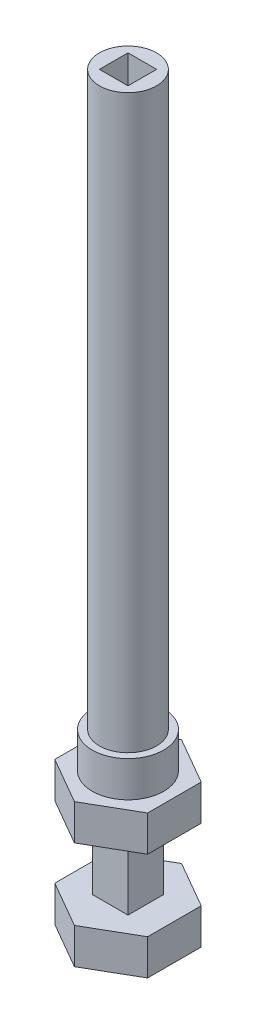
ISO-10303-21;
HEADER;
FILE_DESCRIPTION(('STEP AP214'),'2;1');
FILE_NAME('part.step','',(''),(''),'','','');
FILE_SCHEMA(('AUTOMOTIVE_DESIGN { 1 0 10303 214 1 1 1 1 }'));
ENDSEC;
DATA;
#1=APPLICATION_CONTEXT('core data for automotive mechanical design processes');
#2=APPLICATION_PROTOCOL_DEFINITION('international standard','automotive_design',2000,#1);
#3=PRODUCT_CONTEXT('',#1,'mechanical');
#4=PRODUCT('Part','Part','',(#3));
#5=PRODUCT_RELATED_PRODUCT_CATEGORY('part','',(#4));
#6=PRODUCT_DEFINITION_FORMATION('','',#4);
#7=PRODUCT_DEFINITION_CONTEXT('part definition',#1,'design');
#8=PRODUCT_DEFINITION('design','',#6,#7);
#9=PRODUCT_DEFINITION_SHAPE('','',#8);
#10=(LENGTH_UNIT() NAMED_UNIT(*) SI_UNIT(.MILLI.,.METRE.));
#11=(NAMED_UNIT(*) PLANE_ANGLE_UNIT() SI_UNIT($,.RADIAN.));
#12=(NAMED_UNIT(*) SI_UNIT($,.STERADIAN.) SOLID_ANGLE_UNIT());
#13=UNCERTAINTY_MEASURE_WITH_UNIT(LENGTH_MEASURE(1.E-05),#10,'distance_accuracy_value','');
#14=(GEOMETRIC_REPRESENTATION_CONTEXT(3) GLOBAL_UNCERTAINTY_ASSIGNED_CONTEXT((#13)) GLOBAL_UNIT_ASSIGNED_CONTEXT((#10,
#11,#12)) REPRESENTATION_CONTEXT('',''));
#15=CARTESIAN_POINT('',(0.,0.,0.));
#16=DIRECTION('',(0.,0.,1.));
#17=DIRECTION('',(1.,0.,0.));
#18=AXIS2_PLACEMENT_3D('',#15,#16,#17);
#19=CARTESIAN_POINT('',(-2.5,10.,2.5));
#20=DIRECTION('',(1.,0.,0.));
#21=DIRECTION('',(0.,0.,-1.));
#22=AXIS2_PLACEMENT_3D('',#19,#20,#21);
#23=PLANE('',#22);
#24=DIRECTION('',(0.,0.,1.));
#25=VECTOR('',#24,1.);
#26=CARTESIAN_POINT('',(-2.5,0.,2.5));
#27=LINE('',#26,#25);
#28=CARTESIAN_POINT('',(-2.5,0.,-2.5));
#29=VERTEX_POINT('',#28);
#30=CARTESIAN_POINT('',(-2.5,0.,2.5));
#31=VERTEX_POINT('',#30);
#32=EDGE_CURVE('E88',#29,#31,#27,.T.);
#33=ORIENTED_EDGE('',*,*,#32,.T.);
#34=DIRECTION('',(0.,-1.,0.));
#35=VECTOR('',#34,1.);
#36=CARTESIAN_POINT('',(-2.5,10.,2.5));
#37=LINE('',#36,#35);
#38=CARTESIAN_POINT('',(-2.5,10.,2.5));
#39=VERTEX_POINT('',#38);
#40=EDGE_CURVE('E47',#39,#31,#37,.T.);
#41=ORIENTED_EDGE('',*,*,#40,.F.);
#42=DIRECTION('',(0.,0.,1.));
#43=VECTOR('',#42,1.);
#44=CARTESIAN_POINT('',(-2.5,10.,2.5));
#45=LINE('',#44,#43);
#46=CARTESIAN_POINT('',(-2.5,10.,-2.5));
#47=VERTEX_POINT('',#46);
#48=EDGE_CURVE('E324',#47,#39,#45,.T.);
#49=ORIENTED_EDGE('',*,*,#48,.F.);
#50=DIRECTION('',(0.,-1.,0.));
#51=VECTOR('',#50,1.);
#52=CARTESIAN_POINT('',(-2.5,10.,-2.5));
#53=LINE('',#52,#51);
#54=EDGE_CURVE('E337',#47,#29,#53,.T.);
#55=ORIENTED_EDGE('',*,*,#54,.T.);
#56=EDGE_LOOP('',(#33,#41,#49,#55));
#57=FACE_BOUND('',#56,.T.);
#58=ADVANCED_FACE('F44',(#57),#23,.F.);
#59=CARTESIAN_POINT('',(2.5,10.,2.5));
#60=DIRECTION('',(0.,0.,-1.));
#61=DIRECTION('',(-1.,0.,0.));
#62=AXIS2_PLACEMENT_3D('',#59,#60,#61);
#63=PLANE('',#62);
#64=DIRECTION('',(1.,0.,0.));
#65=VECTOR('',#64,1.);
#66=CARTESIAN_POINT('',(2.5,0.,2.5));
#67=LINE('',#66,#65);
#68=CARTESIAN_POINT('',(2.5,0.,2.5));
#69=VERTEX_POINT('',#68);
#70=EDGE_CURVE('E339',#31,#69,#67,.T.);
#71=ORIENTED_EDGE('',*,*,#70,.T.);
#72=DIRECTION('',(0.,-1.,0.));
#73=VECTOR('',#72,1.);
#74=CARTESIAN_POINT('',(2.5,10.,2.5));
#75=LINE('',#74,#73);
#76=CARTESIAN_POINT('',(2.5,10.,2.5));
#77=VERTEX_POINT('',#76);
#78=EDGE_CURVE('E345',#77,#69,#75,.T.);
#79=ORIENTED_EDGE('',*,*,#78,.F.);
#80=DIRECTION('',(1.,0.,0.));
#81=VECTOR('',#80,1.);
#82=CARTESIAN_POINT('',(2.5,10.,2.5));
#83=LINE('',#82,#81);
#84=EDGE_CURVE('E327',#39,#77,#83,.T.);
#85=ORIENTED_EDGE('',*,*,#84,.F.);
#86=ORIENTED_EDGE('',*,*,#40,.T.);
#87=EDGE_LOOP('',(#71,#79,#85,#86));
#88=FACE_BOUND('',#87,.T.);
#89=ADVANCED_FACE('F350',(#88),#63,.F.);
#90=CARTESIAN_POINT('',(2.5,10.,2.5));
#91=DIRECTION('',(-1.,0.,0.));
#92=DIRECTION('',(0.,0.,1.));
#93=AXIS2_PLACEMENT_3D('',#90,#91,#92);
#94=PLANE('',#93);
#95=DIRECTION('',(0.,0.,-1.));
#96=VECTOR('',#95,1.);
#97=CARTESIAN_POINT('',(2.5,0.,2.5));
#98=LINE('',#97,#96);
#99=CARTESIAN_POINT('',(2.5,0.,-2.5));
#100=VERTEX_POINT('',#99);
#101=EDGE_CURVE('E81',#69,#100,#98,.T.);
#102=ORIENTED_EDGE('',*,*,#101,.T.);
#103=DIRECTION('',(0.,-1.,0.));
#104=VECTOR('',#103,1.);
#105=CARTESIAN_POINT('',(2.5,10.,-2.5));
#106=LINE('',#105,#104);
#107=CARTESIAN_POINT('',(2.5,10.,-2.5));
#108=VERTEX_POINT('',#107);
#109=EDGE_CURVE('E69',#108,#100,#106,.T.);
#110=ORIENTED_EDGE('',*,*,#109,.F.);
#111=DIRECTION('',(0.,0.,-1.));
#112=VECTOR('',#111,1.);
#113=CARTESIAN_POINT('',(2.5,10.,2.5));
#114=LINE('',#113,#112);
#115=EDGE_CURVE('E331',#77,#108,#114,.T.);
#116=ORIENTED_EDGE('',*,*,#115,.F.);
#117=ORIENTED_EDGE('',*,*,#78,.T.);
#118=EDGE_LOOP('',(#102,#110,#116,#117));
#119=FACE_BOUND('',#118,.T.);
#120=ADVANCED_FACE('F357',(#119),#94,.F.);
#121=CARTESIAN_POINT('',(2.5,10.,-2.5));
#122=DIRECTION('',(0.,0.,1.));
#123=DIRECTION('',(1.,0.,0.));
#124=AXIS2_PLACEMENT_3D('',#121,#122,#123);
#125=PLANE('',#124);
#126=DIRECTION('',(-1.,0.,0.));
#127=VECTOR('',#126,1.);
#128=CARTESIAN_POINT('',(2.5,0.,-2.5));
#129=LINE('',#128,#127);
#130=EDGE_CURVE('E328',#100,#29,#129,.T.);
#131=ORIENTED_EDGE('',*,*,#130,.T.);
#132=ORIENTED_EDGE('',*,*,#54,.F.);
#133=DIRECTION('',(-1.,0.,0.));
#134=VECTOR('',#133,1.);
#135=CARTESIAN_POINT('',(2.5,10.,-2.5));
#136=LINE('',#135,#134);
#137=EDGE_CURVE('E334',#108,#47,#136,.T.);
#138=ORIENTED_EDGE('',*,*,#137,.F.);
#139=ORIENTED_EDGE('',*,*,#109,.T.);
#140=EDGE_LOOP('',(#131,#132,#138,#139));
#141=FACE_BOUND('',#140,.T.);
#142=ADVANCED_FACE('F354',(#141),#125,.F.);
#143=CARTESIAN_POINT('',(6.49519052838328,-5.,3.75));
#144=DIRECTION('',(-0.5,0.,-0.866025403784439));
#145=DIRECTION('',(-0.866025403784439,0.,0.5));
#146=AXIS2_PLACEMENT_3D('',#143,#144,#145);
#147=PLANE('',#146);
#148=DIRECTION('',(-0.866025403784439,0.,0.5));
#149=VECTOR('',#148,1.);
#150=CARTESIAN_POINT('',(6.49519052838328,0.,3.75));
#151=LINE('',#150,#149);
#152=CARTESIAN_POINT('',(6.49519052838328,0.,3.75));
#153=VERTEX_POINT('',#152);
#154=CARTESIAN_POINT('',(0.,0.,7.5));
#155=VERTEX_POINT('',#154);
#156=EDGE_CURVE('E280',#153,#155,#151,.T.);
#157=ORIENTED_EDGE('',*,*,#156,.T.);
#158=DIRECTION('',(0.,1.,0.));
#159=VECTOR('',#158,1.);
#160=CARTESIAN_POINT('',(0.,-5.,7.5));
#161=LINE('',#160,#159);
#162=CARTESIAN_POINT('',(0.,-5.,7.5));
#163=VERTEX_POINT('',#162);
#164=EDGE_CURVE('E321',#163,#155,#161,.T.);
#165=ORIENTED_EDGE('',*,*,#164,.F.);
#166=DIRECTION('',(-0.866025403784439,0.,0.5));
#167=VECTOR('',#166,1.);
#168=CARTESIAN_POINT('',(6.49519052838328,-5.,3.75));
#169=LINE('',#168,#167);
#170=CARTESIAN_POINT('',(6.49519052838328,-5.,3.75));
#171=VERTEX_POINT('',#170);
#172=EDGE_CURVE('E281',#171,#163,#169,.T.);
#173=ORIENTED_EDGE('',*,*,#172,.F.);
#174=DIRECTION('',(0.,1.,0.));
#175=VECTOR('',#174,1.);
#176=CARTESIAN_POINT('',(6.49519052838328,-5.,3.75));
#177=LINE('',#176,#175);
#178=EDGE_CURVE('E295',#171,#153,#177,.T.);
#179=ORIENTED_EDGE('',*,*,#178,.T.);
#180=EDGE_LOOP('',(#157,#165,#173,#179));
#181=FACE_BOUND('',#180,.T.);
#182=ADVANCED_FACE('F364',(#181),#147,.F.);
#183=CARTESIAN_POINT('',(0.,-5.,7.5));
#184=DIRECTION('',(0.5,0.,-0.866025403784439));
#185=DIRECTION('',(-0.866025403784439,0.,-0.5));
#186=AXIS2_PLACEMENT_3D('',#183,#184,#185);
#187=PLANE('',#186);
#188=DIRECTION('',(-0.866025403784439,0.,-0.5));
#189=VECTOR('',#188,1.);
#190=CARTESIAN_POINT('',(0.,0.,7.5));
#191=LINE('',#190,#189);
#192=CARTESIAN_POINT('',(-6.49519052838329,0.,3.75));
#193=VERTEX_POINT('',#192);
#194=EDGE_CURVE('E298',#155,#193,#191,.T.);
#195=ORIENTED_EDGE('',*,*,#194,.T.);
#196=DIRECTION('',(0.,1.,0.));
#197=VECTOR('',#196,1.);
#198=CARTESIAN_POINT('',(-6.49519052838329,-5.,3.75));
#199=LINE('',#198,#197);
#200=CARTESIAN_POINT('',(-6.49519052838329,-5.,3.75));
#201=VERTEX_POINT('',#200);
#202=EDGE_CURVE('E318',#201,#193,#199,.T.);
#203=ORIENTED_EDGE('',*,*,#202,.F.);
#204=DIRECTION('',(-0.866025403784439,0.,-0.5));
#205=VECTOR('',#204,1.);
#206=CARTESIAN_POINT('',(0.,-5.,7.5));
#207=LINE('',#206,#205);
#208=EDGE_CURVE('E284',#163,#201,#207,.T.);
#209=ORIENTED_EDGE('',*,*,#208,.F.);
#210=ORIENTED_EDGE('',*,*,#164,.T.);
#211=EDGE_LOOP('',(#195,#203,#209,#210));
#212=FACE_BOUND('',#211,.T.);
#213=ADVANCED_FACE('F393',(#212),#187,.F.);
#214=CARTESIAN_POINT('',(-6.49519052838329,-5.,3.75));
#215=DIRECTION('',(1.,0.,0.));
#216=DIRECTION('',(0.,0.,-1.));
#217=AXIS2_PLACEMENT_3D('',#214,#215,#216);
#218=PLANE('',#217);
#219=DIRECTION('',(0.,0.,-1.));
#220=VECTOR('',#219,1.);
#221=CARTESIAN_POINT('',(-6.49519052838329,0.,3.75));
#222=LINE('',#221,#220);
#223=CARTESIAN_POINT('',(-6.49519052838329,0.,-3.75));
#224=VERTEX_POINT('',#223);
#225=EDGE_CURVE('E300',#193,#224,#222,.T.);
#226=ORIENTED_EDGE('',*,*,#225,.T.);
#227=DIRECTION('',(0.,1.,0.));
#228=VECTOR('',#227,1.);
#229=CARTESIAN_POINT('',(-6.49519052838329,-5.,-3.75));
#230=LINE('',#229,#228);
#231=CARTESIAN_POINT('',(-6.49519052838329,-5.,-3.75));
#232=VERTEX_POINT('',#231);
#233=EDGE_CURVE('E315',#232,#224,#230,.T.);
#234=ORIENTED_EDGE('',*,*,#233,.F.);
#235=DIRECTION('',(0.,0.,-1.));
#236=VECTOR('',#235,1.);
#237=CARTESIAN_POINT('',(-6.49519052838329,-5.,3.75));
#238=LINE('',#237,#236);
#239=EDGE_CURVE('E287',#201,#232,#238,.T.);
#240=ORIENTED_EDGE('',*,*,#239,.F.);
#241=ORIENTED_EDGE('',*,*,#202,.T.);
#242=EDGE_LOOP('',(#226,#234,#240,#241));
#243=FACE_BOUND('',#242,.T.);
#244=ADVANCED_FACE('F403',(#243),#218,.F.);
#245=CARTESIAN_POINT('',(-6.49519052838329,-5.,-3.75));
#246=DIRECTION('',(0.5,0.,0.866025403784439));
#247=DIRECTION('',(0.866025403784439,0.,-0.5));
#248=AXIS2_PLACEMENT_3D('',#245,#246,#247);
#249=PLANE('',#248);
#250=DIRECTION('',(0.866025403784439,0.,-0.5));
#251=VECTOR('',#250,1.);
#252=CARTESIAN_POINT('',(-6.49519052838329,0.,-3.75));
#253=LINE('',#252,#251);
#254=CARTESIAN_POINT('',(0.,0.,-7.5));
#255=VERTEX_POINT('',#254);
#256=EDGE_CURVE('E302',#224,#255,#253,.T.);
#257=ORIENTED_EDGE('',*,*,#256,.T.);
#258=DIRECTION('',(0.,1.,0.));
#259=VECTOR('',#258,1.);
#260=CARTESIAN_POINT('',(0.,-5.,-7.5));
#261=LINE('',#260,#259);
#262=CARTESIAN_POINT('',(0.,-5.,-7.5));
#263=VERTEX_POINT('',#262);
#264=EDGE_CURVE('E312',#263,#255,#261,.T.);
#265=ORIENTED_EDGE('',*,*,#264,.F.);
#266=DIRECTION('',(0.866025403784439,0.,-0.5));
#267=VECTOR('',#266,1.);
#268=CARTESIAN_POINT('',(-6.49519052838329,-5.,-3.75));
#269=LINE('',#268,#267);
#270=EDGE_CURVE('E289',#232,#263,#269,.T.);
#271=ORIENTED_EDGE('',*,*,#270,.F.);
#272=ORIENTED_EDGE('',*,*,#233,.T.);
#273=EDGE_LOOP('',(#257,#265,#271,#272));
#274=FACE_BOUND('',#273,.T.);
#275=ADVANCED_FACE('F413',(#274),#249,.F.);
#276=CARTESIAN_POINT('',(0.,-5.,-7.5));
#277=DIRECTION('',(-0.5,0.,0.866025403784439));
#278=DIRECTION('',(0.866025403784439,0.,0.5));
#279=AXIS2_PLACEMENT_3D('',#276,#277,#278);
#280=PLANE('',#279);
#281=DIRECTION('',(0.866025403784439,0.,0.5));
#282=VECTOR('',#281,1.);
#283=CARTESIAN_POINT('',(0.,0.,-7.5));
#284=LINE('',#283,#282);
#285=CARTESIAN_POINT('',(6.49519052838329,0.,-3.75));
#286=VERTEX_POINT('',#285);
#287=EDGE_CURVE('E304',#255,#286,#284,.T.);
#288=ORIENTED_EDGE('',*,*,#287,.T.);
#289=DIRECTION('',(0.,1.,0.));
#290=VECTOR('',#289,1.);
#291=CARTESIAN_POINT('',(6.49519052838329,-5.,-3.75));
#292=LINE('',#291,#290);
#293=CARTESIAN_POINT('',(6.49519052838329,-5.,-3.75));
#294=VERTEX_POINT('',#293);
#295=EDGE_CURVE('E309',#294,#286,#292,.T.);
#296=ORIENTED_EDGE('',*,*,#295,.F.);
#297=DIRECTION('',(0.866025403784439,0.,0.5));
#298=VECTOR('',#297,1.);
#299=CARTESIAN_POINT('',(0.,-5.,-7.5));
#300=LINE('',#299,#298);
#301=EDGE_CURVE('E291',#263,#294,#300,.T.);
#302=ORIENTED_EDGE('',*,*,#301,.F.);
#303=ORIENTED_EDGE('',*,*,#264,.T.);
#304=EDGE_LOOP('',(#288,#296,#302,#303));
#305=FACE_BOUND('',#304,.T.);
#306=ADVANCED_FACE('F423',(#305),#280,.F.);
#307=CARTESIAN_POINT('',(6.49519052838329,-5.,-3.75));
#308=DIRECTION('',(-1.,0.,0.));
#309=DIRECTION('',(0.,0.,1.));
#310=AXIS2_PLACEMENT_3D('',#307,#308,#309);
#311=PLANE('',#310);
#312=DIRECTION('',(0.,0.,1.));
#313=VECTOR('',#312,1.);
#314=CARTESIAN_POINT('',(6.49519052838329,0.,-3.75));
#315=LINE('',#314,#313);
#316=EDGE_CURVE('E285',#286,#153,#315,.T.);
#317=ORIENTED_EDGE('',*,*,#316,.T.);
#318=ORIENTED_EDGE('',*,*,#178,.F.);
#319=DIRECTION('',(0.,0.,1.));
#320=VECTOR('',#319,1.);
#321=CARTESIAN_POINT('',(6.49519052838329,-5.,-3.75));
#322=LINE('',#321,#320);
#323=EDGE_CURVE('E293',#294,#171,#322,.T.);
#324=ORIENTED_EDGE('',*,*,#323,.F.);
#325=ORIENTED_EDGE('',*,*,#295,.T.);
#326=EDGE_LOOP('',(#317,#318,#324,#325));
#327=FACE_BOUND('',#326,.T.);
#328=ADVANCED_FACE('F433',(#327),#311,.F.);
#329=CARTESIAN_POINT('',(0.,-5.,0.));
#330=DIRECTION('',(0.,-1.,0.));
#331=DIRECTION('',(0.,0.,-1.));
#332=AXIS2_PLACEMENT_3D('',#329,#330,#331);
#333=PLANE('',#332);
#334=ORIENTED_EDGE('',*,*,#172,.T.);
#335=ORIENTED_EDGE('',*,*,#208,.T.);
#336=ORIENTED_EDGE('',*,*,#239,.T.);
#337=ORIENTED_EDGE('',*,*,#270,.T.);
#338=ORIENTED_EDGE('',*,*,#301,.T.);
#339=ORIENTED_EDGE('',*,*,#323,.T.);
#340=EDGE_LOOP('',(#334,#335,#336,#337,#338,#339));
#341=FACE_BOUND('',#340,.T.);
#342=ADVANCED_FACE('F443',(#341),#333,.T.);
#343=CARTESIAN_POINT('',(0.,0.,0.));
#344=DIRECTION('',(0.,-1.,0.));
#345=DIRECTION('',(0.,0.,-1.));
#346=AXIS2_PLACEMENT_3D('',#343,#344,#345);
#347=PLANE('',#346);
#348=ORIENTED_EDGE('',*,*,#32,.F.);
#349=ORIENTED_EDGE('',*,*,#130,.F.);
#350=ORIENTED_EDGE('',*,*,#101,.F.);
#351=ORIENTED_EDGE('',*,*,#70,.F.);
#352=EDGE_LOOP('',(#348,#349,#350,#351));
#353=FACE_BOUND('',#352,.T.);
#354=ORIENTED_EDGE('',*,*,#156,.F.);
#355=ORIENTED_EDGE('',*,*,#316,.F.);
#356=ORIENTED_EDGE('',*,*,#287,.F.);
#357=ORIENTED_EDGE('',*,*,#256,.F.);
#358=ORIENTED_EDGE('',*,*,#225,.F.);
#359=ORIENTED_EDGE('',*,*,#194,.F.);
#360=EDGE_LOOP('',(#354,#355,#356,#357,#358,#359));
#361=FACE_BOUND('',#360,.T.);
#362=ADVANCED_FACE('F453',(#353,#361),#347,.F.);
#363=CARTESIAN_POINT('',(0.,10.,0.));
#364=DIRECTION('',(0.,1.,0.));
#365=DIRECTION('',(0.,0.,1.));
#366=AXIS2_PLACEMENT_3D('',#363,#364,#365);
#367=PLANE('',#366);
#368=DIRECTION('',(0.866025403784439,0.,0.5));
#369=VECTOR('',#368,1.);
#370=CARTESIAN_POINT('',(-6.49519052838329,10.,3.75));
#371=LINE('',#370,#369);
#372=CARTESIAN_POINT('',(-6.49519052838329,10.,3.75));
#373=VERTEX_POINT('',#372);
#374=CARTESIAN_POINT('',(0.,10.,7.5));
#375=VERTEX_POINT('',#374);
#376=EDGE_CURVE('E234',#373,#375,#371,.T.);
#377=ORIENTED_EDGE('',*,*,#376,.F.);
#378=DIRECTION('',(0.,0.,1.));
#379=VECTOR('',#378,1.);
#380=CARTESIAN_POINT('',(-6.49519052838329,10.,-3.75));
#381=LINE('',#380,#379);
#382=CARTESIAN_POINT('',(-6.49519052838329,10.,-3.75));
#383=VERTEX_POINT('',#382);
#384=EDGE_CURVE('E241',#383,#373,#381,.T.);
#385=ORIENTED_EDGE('',*,*,#384,.F.);
#386=DIRECTION('',(-0.866025403784439,0.,0.5));
#387=VECTOR('',#386,1.);
#388=CARTESIAN_POINT('',(0.,10.,-7.5));
#389=LINE('',#388,#387);
#390=CARTESIAN_POINT('',(0.,10.,-7.5));
#391=VERTEX_POINT('',#390);
#392=EDGE_CURVE('E260',#391,#383,#389,.T.);
#393=ORIENTED_EDGE('',*,*,#392,.F.);
#394=DIRECTION('',(-0.866025403784439,0.,-0.5));
#395=VECTOR('',#394,1.);
#396=CARTESIAN_POINT('',(6.49519052838329,10.,-3.75));
#397=LINE('',#396,#395);
#398=CARTESIAN_POINT('',(6.49519052838329,10.,-3.75));
#399=VERTEX_POINT('',#398);
#400=EDGE_CURVE('E258',#399,#391,#397,.T.);
#401=ORIENTED_EDGE('',*,*,#400,.F.);
#402=DIRECTION('',(0.,0.,-1.));
#403=VECTOR('',#402,1.);
#404=CARTESIAN_POINT('',(6.49519052838328,10.,3.75));
#405=LINE('',#404,#403);
#406=CARTESIAN_POINT('',(6.49519052838328,10.,3.75));
#407=VERTEX_POINT('',#406);
#408=EDGE_CURVE('E256',#407,#399,#405,.T.);
#409=ORIENTED_EDGE('',*,*,#408,.F.);
#410=DIRECTION('',(0.866025403784439,0.,-0.5));
#411=VECTOR('',#410,1.);
#412=CARTESIAN_POINT('',(0.,10.,7.5));
#413=LINE('',#412,#411);
#414=EDGE_CURVE('E254',#375,#407,#413,.T.);
#415=ORIENTED_EDGE('',*,*,#414,.F.);
#416=EDGE_LOOP('',(#377,#385,#393,#401,#409,#415));
#417=FACE_BOUND('',#416,.T.);
#418=ORIENTED_EDGE('',*,*,#137,.T.);
#419=ORIENTED_EDGE('',*,*,#48,.T.);
#420=ORIENTED_EDGE('',*,*,#84,.T.);
#421=ORIENTED_EDGE('',*,*,#115,.T.);
#422=EDGE_LOOP('',(#418,#419,#420,#421));
#423=FACE_BOUND('',#422,.T.);
#424=ADVANCED_FACE('F356',(#417,#423),#367,.F.);
#425=CARTESIAN_POINT('',(-6.49519052838329,15.,3.75));
#426=DIRECTION('',(0.5,0.,-0.866025403784439));
#427=DIRECTION('',(-0.866025403784439,0.,-0.5));
#428=AXIS2_PLACEMENT_3D('',#425,#426,#427);
#429=PLANE('',#428);
#430=ORIENTED_EDGE('',*,*,#376,.T.);
#431=DIRECTION('',(0.,-1.,0.));
#432=VECTOR('',#431,1.);
#433=CARTESIAN_POINT('',(0.,15.,7.5));
#434=LINE('',#433,#432);
#435=CARTESIAN_POINT('',(0.,15.,7.5));
#436=VERTEX_POINT('',#435);
#437=EDGE_CURVE('E277',#436,#375,#434,.T.);
#438=ORIENTED_EDGE('',*,*,#437,.F.);
#439=DIRECTION('',(0.866025403784439,0.,0.5));
#440=VECTOR('',#439,1.);
#441=CARTESIAN_POINT('',(-6.49519052838329,15.,3.75));
#442=LINE('',#441,#440);
#443=CARTESIAN_POINT('',(-6.49519052838329,15.,3.75));
#444=VERTEX_POINT('',#443);
#445=EDGE_CURVE('E237',#444,#436,#442,.T.);
#446=ORIENTED_EDGE('',*,*,#445,.F.);
#447=DIRECTION('',(0.,-1.,0.));
#448=VECTOR('',#447,1.);
#449=CARTESIAN_POINT('',(-6.49519052838329,15.,3.75));
#450=LINE('',#449,#448);
#451=EDGE_CURVE('E251',#444,#373,#450,.T.);
#452=ORIENTED_EDGE('',*,*,#451,.T.);
#453=EDGE_LOOP('',(#430,#438,#446,#452));
#454=FACE_BOUND('',#453,.T.);
#455=ADVANCED_FACE('F470',(#454),#429,.F.);
#456=CARTESIAN_POINT('',(0.,15.,7.5));
#457=DIRECTION('',(-0.5,0.,-0.866025403784439));
#458=DIRECTION('',(-0.866025403784439,0.,0.5));
#459=AXIS2_PLACEMENT_3D('',#456,#457,#458);
#460=PLANE('',#459);
#461=ORIENTED_EDGE('',*,*,#414,.T.);
#462=DIRECTION('',(0.,-1.,0.));
#463=VECTOR('',#462,1.);
#464=CARTESIAN_POINT('',(6.49519052838328,15.,3.75));
#465=LINE('',#464,#463);
#466=CARTESIAN_POINT('',(6.49519052838328,15.,3.75));
#467=VERTEX_POINT('',#466);
#468=EDGE_CURVE('E274',#467,#407,#465,.T.);
#469=ORIENTED_EDGE('',*,*,#468,.F.);
#470=DIRECTION('',(0.866025403784439,0.,-0.5));
#471=VECTOR('',#470,1.);
#472=CARTESIAN_POINT('',(0.,15.,7.5));
#473=LINE('',#472,#471);
#474=EDGE_CURVE('E240',#436,#467,#473,.T.);
#475=ORIENTED_EDGE('',*,*,#474,.F.);
#476=ORIENTED_EDGE('',*,*,#437,.T.);
#477=EDGE_LOOP('',(#461,#469,#475,#476));
#478=FACE_BOUND('',#477,.T.);
#479=ADVANCED_FACE('F480',(#478),#460,.F.);
#480=CARTESIAN_POINT('',(6.49519052838328,15.,3.75));
#481=DIRECTION('',(-1.,0.,0.));
#482=DIRECTION('',(0.,0.,1.));
#483=AXIS2_PLACEMENT_3D('',#480,#481,#482);
#484=PLANE('',#483);
#485=ORIENTED_EDGE('',*,*,#408,.T.);
#486=DIRECTION('',(0.,-1.,0.));
#487=VECTOR('',#486,1.);
#488=CARTESIAN_POINT('',(6.49519052838329,15.,-3.75));
#489=LINE('',#488,#487);
#490=CARTESIAN_POINT('',(6.49519052838329,15.,-3.75));
#491=VERTEX_POINT('',#490);
#492=EDGE_CURVE('E271',#491,#399,#489,.T.);
#493=ORIENTED_EDGE('',*,*,#492,.F.);
#494=DIRECTION('',(0.,0.,-1.));
#495=VECTOR('',#494,1.);
#496=CARTESIAN_POINT('',(6.49519052838328,15.,3.75));
#497=LINE('',#496,#495);
#498=EDGE_CURVE('E243',#467,#491,#497,.T.);
#499=ORIENTED_EDGE('',*,*,#498,.F.);
#500=ORIENTED_EDGE('',*,*,#468,.T.);
#501=EDGE_LOOP('',(#485,#493,#499,#500));
#502=FACE_BOUND('',#501,.T.);
#503=ADVANCED_FACE('F490',(#502),#484,.F.);
#504=CARTESIAN_POINT('',(6.49519052838329,15.,-3.75));
#505=DIRECTION('',(-0.5,0.,0.866025403784439));
#506=DIRECTION('',(0.866025403784439,0.,0.5));
#507=AXIS2_PLACEMENT_3D('',#504,#505,#506);
#508=PLANE('',#507);
#509=ORIENTED_EDGE('',*,*,#400,.T.);
#510=DIRECTION('',(0.,-1.,0.));
#511=VECTOR('',#510,1.);
#512=CARTESIAN_POINT('',(0.,15.,-7.5));
#513=LINE('',#512,#511);
#514=CARTESIAN_POINT('',(0.,15.,-7.5));
#515=VERTEX_POINT('',#514);
#516=EDGE_CURVE('E268',#515,#391,#513,.T.);
#517=ORIENTED_EDGE('',*,*,#516,.F.);
#518=DIRECTION('',(-0.866025403784439,0.,-0.5));
#519=VECTOR('',#518,1.);
#520=CARTESIAN_POINT('',(6.49519052838329,15.,-3.75));
#521=LINE('',#520,#519);
#522=EDGE_CURVE('E245',#491,#515,#521,.T.);
#523=ORIENTED_EDGE('',*,*,#522,.F.);
#524=ORIENTED_EDGE('',*,*,#492,.T.);
#525=EDGE_LOOP('',(#509,#517,#523,#524));
#526=FACE_BOUND('',#525,.T.);
#527=ADVANCED_FACE('F500',(#526),#508,.F.);
#528=CARTESIAN_POINT('',(0.,15.,-7.5));
#529=DIRECTION('',(0.5,0.,0.866025403784439));
#530=DIRECTION('',(0.866025403784439,0.,-0.5));
#531=AXIS2_PLACEMENT_3D('',#528,#529,#530);
#532=PLANE('',#531);
#533=ORIENTED_EDGE('',*,*,#392,.T.);
#534=DIRECTION('',(0.,-1.,0.));
#535=VECTOR('',#534,1.);
#536=CARTESIAN_POINT('',(-6.49519052838329,15.,-3.75));
#537=LINE('',#536,#535);
#538=CARTESIAN_POINT('',(-6.49519052838329,15.,-3.75));
#539=VERTEX_POINT('',#538);
#540=EDGE_CURVE('E265',#539,#383,#537,.T.);
#541=ORIENTED_EDGE('',*,*,#540,.F.);
#542=DIRECTION('',(-0.866025403784439,0.,0.5));
#543=VECTOR('',#542,1.);
#544=CARTESIAN_POINT('',(0.,15.,-7.5));
#545=LINE('',#544,#543);
#546=EDGE_CURVE('E247',#515,#539,#545,.T.);
#547=ORIENTED_EDGE('',*,*,#546,.F.);
#548=ORIENTED_EDGE('',*,*,#516,.T.);
#549=EDGE_LOOP('',(#533,#541,#547,#548));
#550=FACE_BOUND('',#549,.T.);
#551=ADVANCED_FACE('F510',(#550),#532,.F.);
#552=CARTESIAN_POINT('',(-6.49519052838329,15.,-3.75));
#553=DIRECTION('',(1.,0.,0.));
#554=DIRECTION('',(0.,0.,-1.));
#555=AXIS2_PLACEMENT_3D('',#552,#553,#554);
#556=PLANE('',#555);
#557=ORIENTED_EDGE('',*,*,#384,.T.);
#558=ORIENTED_EDGE('',*,*,#451,.F.);
#559=DIRECTION('',(0.,0.,1.));
#560=VECTOR('',#559,1.);
#561=CARTESIAN_POINT('',(-6.49519052838329,15.,-3.75));
#562=LINE('',#561,#560);
#563=EDGE_CURVE('E249',#539,#444,#562,.T.);
#564=ORIENTED_EDGE('',*,*,#563,.F.);
#565=ORIENTED_EDGE('',*,*,#540,.T.);
#566=EDGE_LOOP('',(#557,#558,#564,#565));
#567=FACE_BOUND('',#566,.T.);
#568=ADVANCED_FACE('F520',(#567),#556,.F.);
#569=CARTESIAN_POINT('',(0.,15.,0.));
#570=DIRECTION('',(0.,1.,0.));
#571=DIRECTION('',(0.,0.,1.));
#572=AXIS2_PLACEMENT_3D('',#569,#570,#571);
#573=PLANE('',#572);
#574=CARTESIAN_POINT('',(0.,15.,0.));
#575=DIRECTION('',(0.,1.,0.));
#576=DIRECTION('',(0.,0.,1.));
#577=AXIS2_PLACEMENT_3D('',#574,#575,#576);
#578=CIRCLE('',#577,5.);
#579=CARTESIAN_POINT('',(0.,15.,5.));
#580=VERTEX_POINT('',#579);
#581=EDGE_CURVE('E52',#580,#580,#578,.T.);
#582=ORIENTED_EDGE('',*,*,#581,.F.);
#583=EDGE_LOOP('',(#582));
#584=FACE_BOUND('',#583,.T.);
#585=ORIENTED_EDGE('',*,*,#445,.T.);
#586=ORIENTED_EDGE('',*,*,#474,.T.);
#587=ORIENTED_EDGE('',*,*,#498,.T.);
#588=ORIENTED_EDGE('',*,*,#522,.T.);
#589=ORIENTED_EDGE('',*,*,#546,.T.);
#590=ORIENTED_EDGE('',*,*,#563,.T.);
#591=EDGE_LOOP('',(#585,#586,#587,#588,#589,#590));
#592=FACE_BOUND('',#591,.T.);
#593=ADVANCED_FACE('F530',(#584,#592),#573,.T.);
#594=CARTESIAN_POINT('',(0.,20.,0.));
#595=DIRECTION('',(0.,-1.,0.));
#596=DIRECTION('',(0.,0.,-1.));
#597=AXIS2_PLACEMENT_3D('',#594,#595,#596);
#598=CYLINDRICAL_SURFACE('',#597,5.);
#599=CARTESIAN_POINT('',(0.,20.,0.));
#600=DIRECTION('',(0.,1.,0.));
#601=DIRECTION('',(0.,0.,1.));
#602=AXIS2_PLACEMENT_3D('',#599,#600,#601);
#603=CIRCLE('',#602,5.);
#604=CARTESIAN_POINT('',(0.,20.,5.));
#605=VERTEX_POINT('',#604);
#606=EDGE_CURVE('E231',#605,#605,#603,.T.);
#607=ORIENTED_EDGE('',*,*,#606,.F.);
#608=EDGE_LOOP('',(#607));
#609=FACE_BOUND('',#608,.T.);
#610=ORIENTED_EDGE('',*,*,#581,.T.);
#611=EDGE_LOOP('',(#610));
#612=FACE_BOUND('',#611,.T.);
#613=ADVANCED_FACE('F540',(#609,#612),#598,.T.);
#614=CARTESIAN_POINT('',(0.,20.,0.));
#615=DIRECTION('',(0.,1.,0.));
#616=DIRECTION('',(0.,0.,1.));
#617=AXIS2_PLACEMENT_3D('',#614,#615,#616);
#618=PLANE('',#617);
#619=CARTESIAN_POINT('',(0.,20.,0.));
#620=DIRECTION('',(0.,1.,0.));
#621=DIRECTION('',(0.,0.,1.));
#622=AXIS2_PLACEMENT_3D('',#619,#620,#621);
#623=CIRCLE('',#622,4.);
#624=CARTESIAN_POINT('',(0.,20.,4.));
#625=VERTEX_POINT('',#624);
#626=EDGE_CURVE('E12',#625,#625,#623,.T.);
#627=ORIENTED_EDGE('',*,*,#626,.F.);
#628=EDGE_LOOP('',(#627));
#629=FACE_BOUND('',#628,.T.);
#630=ORIENTED_EDGE('',*,*,#606,.T.);
#631=EDGE_LOOP('',(#630));
#632=FACE_BOUND('',#631,.T.);
#633=ADVANCED_FACE('F550',(#629,#632),#618,.T.);
#634=CARTESIAN_POINT('',(0.,201.313708498985,0.));
#635=DIRECTION('',(0.,-1.,0.));
#636=DIRECTION('',(0.,0.,-1.));
#637=AXIS2_PLACEMENT_3D('',#634,#635,#636);
#638=CYLINDRICAL_SURFACE('',#637,4.);
#639=ORIENTED_EDGE('',*,*,#626,.T.);
#640=EDGE_LOOP('',(#639));
#641=FACE_BOUND('',#640,.T.);
#642=CARTESIAN_POINT('',(0.,100.,0.));
#643=DIRECTION('',(0.,1.,0.));
#644=DIRECTION('',(0.,0.,1.));
#645=AXIS2_PLACEMENT_3D('',#642,#643,#644);
#646=CIRCLE('',#645,4.);
#647=CARTESIAN_POINT('',(0.,100.,4.));
#648=VERTEX_POINT('',#647);
#649=EDGE_CURVE('E225',#648,#648,#646,.T.);
#650=ORIENTED_EDGE('',*,*,#649,.F.);
#651=EDGE_LOOP('',(#650));
#652=FACE_BOUND('',#651,.T.);
#653=ADVANCED_FACE('F560',(#641,#652),#638,.T.);
#654=CARTESIAN_POINT('',(0.,100.,0.));
#655=DIRECTION('',(0.,1.,0.));
#656=DIRECTION('',(0.,0.,1.));
#657=AXIS2_PLACEMENT_3D('',#654,#655,#656);
#658=PLANE('',#657);
#659=DIRECTION('',(0.,0.,1.));
#660=VECTOR('',#659,1.);
#661=CARTESIAN_POINT('',(-2.,100.,2.));
#662=LINE('',#661,#660);
#663=CARTESIAN_POINT('',(-2.,100.,-2.));
#664=VERTEX_POINT('',#663);
#665=CARTESIAN_POINT('',(-2.,100.,2.));
#666=VERTEX_POINT('',#665);
#667=EDGE_CURVE('E60',#664,#666,#662,.T.);
#668=ORIENTED_EDGE('',*,*,#667,.F.);
#669=DIRECTION('',(-1.,0.,0.));
#670=VECTOR('',#669,1.);
#671=CARTESIAN_POINT('',(2.,100.,-2.));
#672=LINE('',#671,#670);
#673=CARTESIAN_POINT('',(2.,100.,-2.));
#674=VERTEX_POINT('',#673);
#675=EDGE_CURVE('E210',#674,#664,#672,.T.);
#676=ORIENTED_EDGE('',*,*,#675,.F.);
#677=DIRECTION('',(0.,0.,-1.));
#678=VECTOR('',#677,1.);
#679=CARTESIAN_POINT('',(2.,100.,2.));
#680=LINE('',#679,#678);
#681=CARTESIAN_POINT('',(2.,100.,2.));
#682=VERTEX_POINT('',#681);
#683=EDGE_CURVE('E213',#682,#674,#680,.T.);
#684=ORIENTED_EDGE('',*,*,#683,.F.);
#685=DIRECTION('',(1.,0.,0.));
#686=VECTOR('',#685,1.);
#687=CARTESIAN_POINT('',(2.,100.,2.));
#688=LINE('',#687,#686);
#689=EDGE_CURVE('E219',#666,#682,#688,.T.);
#690=ORIENTED_EDGE('',*,*,#689,.F.);
#691=EDGE_LOOP('',(#668,#676,#684,#690));
#692=FACE_BOUND('',#691,.T.);
#693=ORIENTED_EDGE('',*,*,#649,.T.);
#694=EDGE_LOOP('',(#693));
#695=FACE_BOUND('',#694,.T.);
#696=ADVANCED_FACE('F570',(#692,#695),#658,.T.);
#697=CARTESIAN_POINT('',(-2.,96.,2.));
#698=DIRECTION('',(-1.,0.,0.));
#699=DIRECTION('',(0.,0.,1.));
#700=AXIS2_PLACEMENT_3D('',#697,#698,#699);
#701=PLANE('',#700);
#702=ORIENTED_EDGE('',*,*,#667,.T.);
#703=DIRECTION('',(0.,1.,0.));
#704=VECTOR('',#703,1.);
#705=CARTESIAN_POINT('',(-2.,96.,2.));
#706=LINE('',#705,#704);
#707=CARTESIAN_POINT('',(-2.,96.,2.));
#708=VERTEX_POINT('',#707);
#709=EDGE_CURVE('E188',#708,#666,#706,.T.);
#710=ORIENTED_EDGE('',*,*,#709,.F.);
#711=DIRECTION('',(0.,0.,1.));
#712=VECTOR('',#711,1.);
#713=CARTESIAN_POINT('',(-2.,96.,2.));
#714=LINE('',#713,#712);
#715=CARTESIAN_POINT('',(-2.,96.,-2.));
#716=VERTEX_POINT('',#715);
#717=EDGE_CURVE('E192',#716,#708,#714,.T.);
#718=ORIENTED_EDGE('',*,*,#717,.F.);
#719=DIRECTION('',(0.,1.,0.));
#720=VECTOR('',#719,1.);
#721=CARTESIAN_POINT('',(-2.,96.,-2.));
#722=LINE('',#721,#720);
#723=EDGE_CURVE('E223',#716,#664,#722,.T.);
#724=ORIENTED_EDGE('',*,*,#723,.T.);
#725=EDGE_LOOP('',(#702,#710,#718,#724));
#726=FACE_BOUND('',#725,.T.);
#727=ADVANCED_FACE('F190',(#726),#701,.F.);
#728=CARTESIAN_POINT('',(2.,96.,-2.));
#729=DIRECTION('',(0.,0.,-1.));
#730=DIRECTION('',(-1.,0.,0.));
#731=AXIS2_PLACEMENT_3D('',#728,#729,#730);
#732=PLANE('',#731);
#733=ORIENTED_EDGE('',*,*,#675,.T.);
#734=ORIENTED_EDGE('',*,*,#723,.F.);
#735=DIRECTION('',(-1.,0.,0.));
#736=VECTOR('',#735,1.);
#737=CARTESIAN_POINT('',(2.,96.,-2.));
#738=LINE('',#737,#736);
#739=CARTESIAN_POINT('',(2.,96.,-2.));
#740=VERTEX_POINT('',#739);
#741=EDGE_CURVE('E198',#740,#716,#738,.T.);
#742=ORIENTED_EDGE('',*,*,#741,.F.);
#743=DIRECTION('',(0.,1.,0.));
#744=VECTOR('',#743,1.);
#745=CARTESIAN_POINT('',(2.,96.,-2.));
#746=LINE('',#745,#744);
#747=EDGE_CURVE('E226',#740,#674,#746,.T.);
#748=ORIENTED_EDGE('',*,*,#747,.T.);
#749=EDGE_LOOP('',(#733,#734,#742,#748));
#750=FACE_BOUND('',#749,.T.);
#751=ADVANCED_FACE('F589',(#750),#732,.F.);
#752=CARTESIAN_POINT('',(2.,96.,2.));
#753=DIRECTION('',(1.,0.,0.));
#754=DIRECTION('',(0.,0.,-1.));
#755=AXIS2_PLACEMENT_3D('',#752,#753,#754);
#756=PLANE('',#755);
#757=ORIENTED_EDGE('',*,*,#683,.T.);
#758=ORIENTED_EDGE('',*,*,#747,.F.);
#759=DIRECTION('',(0.,0.,-1.));
#760=VECTOR('',#759,1.);
#761=CARTESIAN_POINT('',(2.,96.,2.));
#762=LINE('',#761,#760);
#763=CARTESIAN_POINT('',(2.,96.,2.));
#764=VERTEX_POINT('',#763);
#765=EDGE_CURVE('E206',#764,#740,#762,.T.);
#766=ORIENTED_EDGE('',*,*,#765,.F.);
#767=DIRECTION('',(0.,1.,0.));
#768=VECTOR('',#767,1.);
#769=CARTESIAN_POINT('',(2.,96.,2.));
#770=LINE('',#769,#768);
#771=EDGE_CURVE('E197',#764,#682,#770,.T.);
#772=ORIENTED_EDGE('',*,*,#771,.T.);
#773=EDGE_LOOP('',(#757,#758,#766,#772));
#774=FACE_BOUND('',#773,.T.);
#775=ADVANCED_FACE('F598',(#774),#756,.F.);
#776=CARTESIAN_POINT('',(2.,96.,2.));
#777=DIRECTION('',(0.,0.,1.));
#778=DIRECTION('',(1.,0.,0.));
#779=AXIS2_PLACEMENT_3D('',#776,#777,#778);
#780=PLANE('',#779);
#781=ORIENTED_EDGE('',*,*,#689,.T.);
#782=ORIENTED_EDGE('',*,*,#771,.F.);
#783=DIRECTION('',(1.,0.,0.));
#784=VECTOR('',#783,1.);
#785=CARTESIAN_POINT('',(2.,96.,2.));
#786=LINE('',#785,#784);
#787=EDGE_CURVE('E201',#708,#764,#786,.T.);
#788=ORIENTED_EDGE('',*,*,#787,.F.);
#789=ORIENTED_EDGE('',*,*,#709,.T.);
#790=EDGE_LOOP('',(#781,#782,#788,#789));
#791=FACE_BOUND('',#790,.T.);
#792=ADVANCED_FACE('F202',(#791),#780,.F.);
#793=CARTESIAN_POINT('',(0.,96.,0.));
#794=DIRECTION('',(0.,1.,0.));
#795=DIRECTION('',(0.,0.,1.));
#796=AXIS2_PLACEMENT_3D('',#793,#794,#795);
#797=PLANE('',#796);
#798=ORIENTED_EDGE('',*,*,#717,.T.);
#799=ORIENTED_EDGE('',*,*,#787,.T.);
#800=ORIENTED_EDGE('',*,*,#765,.T.);
#801=ORIENTED_EDGE('',*,*,#741,.T.);
#802=EDGE_LOOP('',(#798,#799,#800,#801));
#803=FACE_BOUND('',#802,.T.);
#804=ADVANCED_FACE('F208',(#803),#797,.T.);
#805=CLOSED_SHELL('',(#58,#89,#120,#142,#182,#213,#244,#275,#306,#328,#342,#362,#424,#455,#479,
#503,#527,#551,#568,#593,#613,#633,#653,#696,#727,#751,#775,#792,#804));
#806=MANIFOLD_SOLID_BREP('B2',#805);
#807=ADVANCED_BREP_SHAPE_REPRESENTATION('',(#18,#806),#14);
#808=SHAPE_DEFINITION_REPRESENTATION(#9,#807);
ENDSEC;
END-ISO-10303-21;
